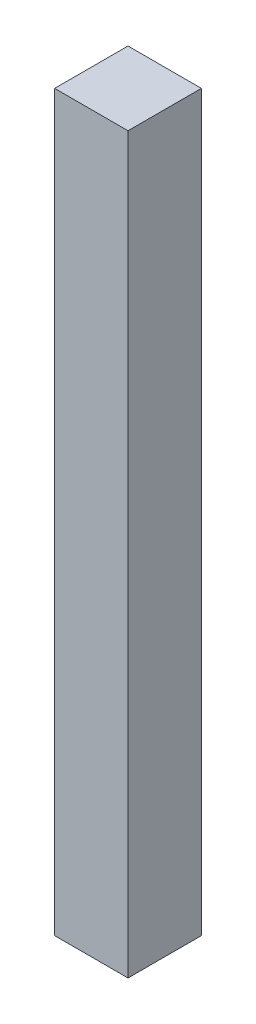
ISO-10303-21;
HEADER;
FILE_DESCRIPTION(('STEP AP214'),'2;1');
FILE_NAME('part.step','',(''),(''),'','','');
FILE_SCHEMA(('AUTOMOTIVE_DESIGN { 1 0 10303 214 1 1 1 1 }'));
ENDSEC;
DATA;
#1=APPLICATION_CONTEXT('core data for automotive mechanical design processes');
#2=APPLICATION_PROTOCOL_DEFINITION('international standard','automotive_design',2000,#1);
#3=PRODUCT_CONTEXT('',#1,'mechanical');
#4=PRODUCT('Part','Part','',(#3));
#5=PRODUCT_RELATED_PRODUCT_CATEGORY('part','',(#4));
#6=PRODUCT_DEFINITION_FORMATION('','',#4);
#7=PRODUCT_DEFINITION_CONTEXT('part definition',#1,'design');
#8=PRODUCT_DEFINITION('design','',#6,#7);
#9=PRODUCT_DEFINITION_SHAPE('','',#8);
#10=(LENGTH_UNIT() NAMED_UNIT(*) SI_UNIT(.MILLI.,.METRE.));
#11=(NAMED_UNIT(*) PLANE_ANGLE_UNIT() SI_UNIT($,.RADIAN.));
#12=(NAMED_UNIT(*) SI_UNIT($,.STERADIAN.) SOLID_ANGLE_UNIT());
#13=UNCERTAINTY_MEASURE_WITH_UNIT(LENGTH_MEASURE(1.E-05),#10,'distance_accuracy_value','');
#14=(GEOMETRIC_REPRESENTATION_CONTEXT(3) GLOBAL_UNCERTAINTY_ASSIGNED_CONTEXT((#13)) GLOBAL_UNIT_ASSIGNED_CONTEXT((#10,
#11,#12)) REPRESENTATION_CONTEXT('',''));
#15=CARTESIAN_POINT('',(0.,0.,0.));
#16=DIRECTION('',(0.,0.,1.));
#17=DIRECTION('',(1.,0.,0.));
#18=AXIS2_PLACEMENT_3D('',#15,#16,#17);
#19=CARTESIAN_POINT('',(10.,200.,10.));
#20=DIRECTION('',(-1.,0.,0.));
#21=DIRECTION('',(0.,0.,1.));
#22=AXIS2_PLACEMENT_3D('',#19,#20,#21);
#23=PLANE('',#22);
#24=DIRECTION('',(0.,0.,-1.));
#25=VECTOR('',#24,1.);
#26=CARTESIAN_POINT('',(10.,0.,10.));
#27=LINE('',#26,#25);
#28=CARTESIAN_POINT('',(10.,0.,10.));
#29=VERTEX_POINT('',#28);
#30=CARTESIAN_POINT('',(10.,0.,-10.));
#31=VERTEX_POINT('',#30);
#32=EDGE_CURVE('E96',#29,#31,#27,.T.);
#33=ORIENTED_EDGE('',*,*,#32,.T.);
#34=DIRECTION('',(0.,-1.,0.));
#35=VECTOR('',#34,1.);
#36=CARTESIAN_POINT('',(10.,200.,-10.));
#37=LINE('',#36,#35);
#38=CARTESIAN_POINT('',(10.,200.,-10.));
#39=VERTEX_POINT('',#38);
#40=EDGE_CURVE('E11',#39,#31,#37,.T.);
#41=ORIENTED_EDGE('',*,*,#40,.F.);
#42=DIRECTION('',(0.,0.,-1.));
#43=VECTOR('',#42,1.);
#44=CARTESIAN_POINT('',(10.,200.,10.));
#45=LINE('',#44,#43);
#46=CARTESIAN_POINT('',(10.,200.,10.));
#47=VERTEX_POINT('',#46);
#48=EDGE_CURVE('E84',#47,#39,#45,.T.);
#49=ORIENTED_EDGE('',*,*,#48,.F.);
#50=DIRECTION('',(0.,-1.,0.));
#51=VECTOR('',#50,1.);
#52=CARTESIAN_POINT('',(10.,200.,10.));
#53=LINE('',#52,#51);
#54=EDGE_CURVE('E92',#47,#29,#53,.T.);
#55=ORIENTED_EDGE('',*,*,#54,.T.);
#56=EDGE_LOOP('',(#33,#41,#49,#55));
#57=FACE_BOUND('',#56,.T.);
#58=ADVANCED_FACE('F33',(#57),#23,.F.);
#59=CARTESIAN_POINT('',(-10.,200.,-10.));
#60=DIRECTION('',(0.,0.,1.));
#61=DIRECTION('',(1.,0.,0.));
#62=AXIS2_PLACEMENT_3D('',#59,#60,#61);
#63=PLANE('',#62);
#64=DIRECTION('',(-1.,0.,0.));
#65=VECTOR('',#64,1.);
#66=CARTESIAN_POINT('',(-10.,0.,-10.));
#67=LINE('',#66,#65);
#68=CARTESIAN_POINT('',(-10.,0.,-10.));
#69=VERTEX_POINT('',#68);
#70=EDGE_CURVE('E88',#31,#69,#67,.T.);
#71=ORIENTED_EDGE('',*,*,#70,.T.);
#72=DIRECTION('',(0.,-1.,0.));
#73=VECTOR('',#72,1.);
#74=CARTESIAN_POINT('',(-10.,200.,-10.));
#75=LINE('',#74,#73);
#76=CARTESIAN_POINT('',(-10.,200.,-10.));
#77=VERTEX_POINT('',#76);
#78=EDGE_CURVE('E41',#77,#69,#75,.T.);
#79=ORIENTED_EDGE('',*,*,#78,.F.);
#80=DIRECTION('',(-1.,0.,0.));
#81=VECTOR('',#80,1.);
#82=CARTESIAN_POINT('',(-10.,200.,-10.));
#83=LINE('',#82,#81);
#84=EDGE_CURVE('E79',#39,#77,#83,.T.);
#85=ORIENTED_EDGE('',*,*,#84,.F.);
#86=ORIENTED_EDGE('',*,*,#40,.T.);
#87=EDGE_LOOP('',(#71,#79,#85,#86));
#88=FACE_BOUND('',#87,.T.);
#89=ADVANCED_FACE('F87',(#88),#63,.F.);
#90=CARTESIAN_POINT('',(-10.,200.,10.));
#91=DIRECTION('',(1.,0.,0.));
#92=DIRECTION('',(0.,0.,-1.));
#93=AXIS2_PLACEMENT_3D('',#90,#91,#92);
#94=PLANE('',#93);
#95=DIRECTION('',(0.,0.,1.));
#96=VECTOR('',#95,1.);
#97=CARTESIAN_POINT('',(-10.,0.,10.));
#98=LINE('',#97,#96);
#99=CARTESIAN_POINT('',(-10.,0.,10.));
#100=VERTEX_POINT('',#99);
#101=EDGE_CURVE('E66',#69,#100,#98,.T.);
#102=ORIENTED_EDGE('',*,*,#101,.T.);
#103=DIRECTION('',(0.,-1.,0.));
#104=VECTOR('',#103,1.);
#105=CARTESIAN_POINT('',(-10.,200.,10.));
#106=LINE('',#105,#104);
#107=CARTESIAN_POINT('',(-10.,200.,10.));
#108=VERTEX_POINT('',#107);
#109=EDGE_CURVE('E89',#108,#100,#106,.T.);
#110=ORIENTED_EDGE('',*,*,#109,.F.);
#111=DIRECTION('',(0.,0.,1.));
#112=VECTOR('',#111,1.);
#113=CARTESIAN_POINT('',(-10.,200.,10.));
#114=LINE('',#113,#112);
#115=EDGE_CURVE('E82',#77,#108,#114,.T.);
#116=ORIENTED_EDGE('',*,*,#115,.F.);
#117=ORIENTED_EDGE('',*,*,#78,.T.);
#118=EDGE_LOOP('',(#102,#110,#116,#117));
#119=FACE_BOUND('',#118,.T.);
#120=ADVANCED_FACE('F90',(#119),#94,.F.);
#121=CARTESIAN_POINT('',(-10.,200.,10.));
#122=DIRECTION('',(0.,0.,-1.));
#123=DIRECTION('',(-1.,0.,0.));
#124=AXIS2_PLACEMENT_3D('',#121,#122,#123);
#125=PLANE('',#124);
#126=DIRECTION('',(1.,0.,0.));
#127=VECTOR('',#126,1.);
#128=CARTESIAN_POINT('',(-10.,0.,10.));
#129=LINE('',#128,#127);
#130=EDGE_CURVE('E72',#100,#29,#129,.T.);
#131=ORIENTED_EDGE('',*,*,#130,.T.);
#132=ORIENTED_EDGE('',*,*,#54,.F.);
#133=DIRECTION('',(1.,0.,0.));
#134=VECTOR('',#133,1.);
#135=CARTESIAN_POINT('',(-10.,200.,10.));
#136=LINE('',#135,#134);
#137=EDGE_CURVE('E49',#108,#47,#136,.T.);
#138=ORIENTED_EDGE('',*,*,#137,.F.);
#139=ORIENTED_EDGE('',*,*,#109,.T.);
#140=EDGE_LOOP('',(#131,#132,#138,#139));
#141=FACE_BOUND('',#140,.T.);
#142=ADVANCED_FACE('F103',(#141),#125,.F.);
#143=CARTESIAN_POINT('',(0.,200.,0.));
#144=DIRECTION('',(0.,-1.,0.));
#145=DIRECTION('',(0.,0.,-1.));
#146=AXIS2_PLACEMENT_3D('',#143,#144,#145);
#147=PLANE('',#146);
#148=ORIENTED_EDGE('',*,*,#48,.T.);
#149=ORIENTED_EDGE('',*,*,#84,.T.);
#150=ORIENTED_EDGE('',*,*,#115,.T.);
#151=ORIENTED_EDGE('',*,*,#137,.T.);
#152=EDGE_LOOP('',(#148,#149,#150,#151));
#153=FACE_BOUND('',#152,.T.);
#154=ADVANCED_FACE('F80',(#153),#147,.F.);
#155=CARTESIAN_POINT('',(0.,0.,0.));
#156=DIRECTION('',(0.,-1.,0.));
#157=DIRECTION('',(0.,0.,-1.));
#158=AXIS2_PLACEMENT_3D('',#155,#156,#157);
#159=PLANE('',#158);
#160=ORIENTED_EDGE('',*,*,#32,.F.);
#161=ORIENTED_EDGE('',*,*,#130,.F.);
#162=ORIENTED_EDGE('',*,*,#101,.F.);
#163=ORIENTED_EDGE('',*,*,#70,.F.);
#164=EDGE_LOOP('',(#160,#161,#162,#163));
#165=FACE_BOUND('',#164,.T.);
#166=ADVANCED_FACE('F106',(#165),#159,.T.);
#167=CLOSED_SHELL('',(#58,#89,#120,#142,#154,#166));
#168=MANIFOLD_SOLID_BREP('B2',#167);
#169=ADVANCED_BREP_SHAPE_REPRESENTATION('',(#18,#168),#14);
#170=SHAPE_DEFINITION_REPRESENTATION(#9,#169);
ENDSEC;
END-ISO-10303-21;
